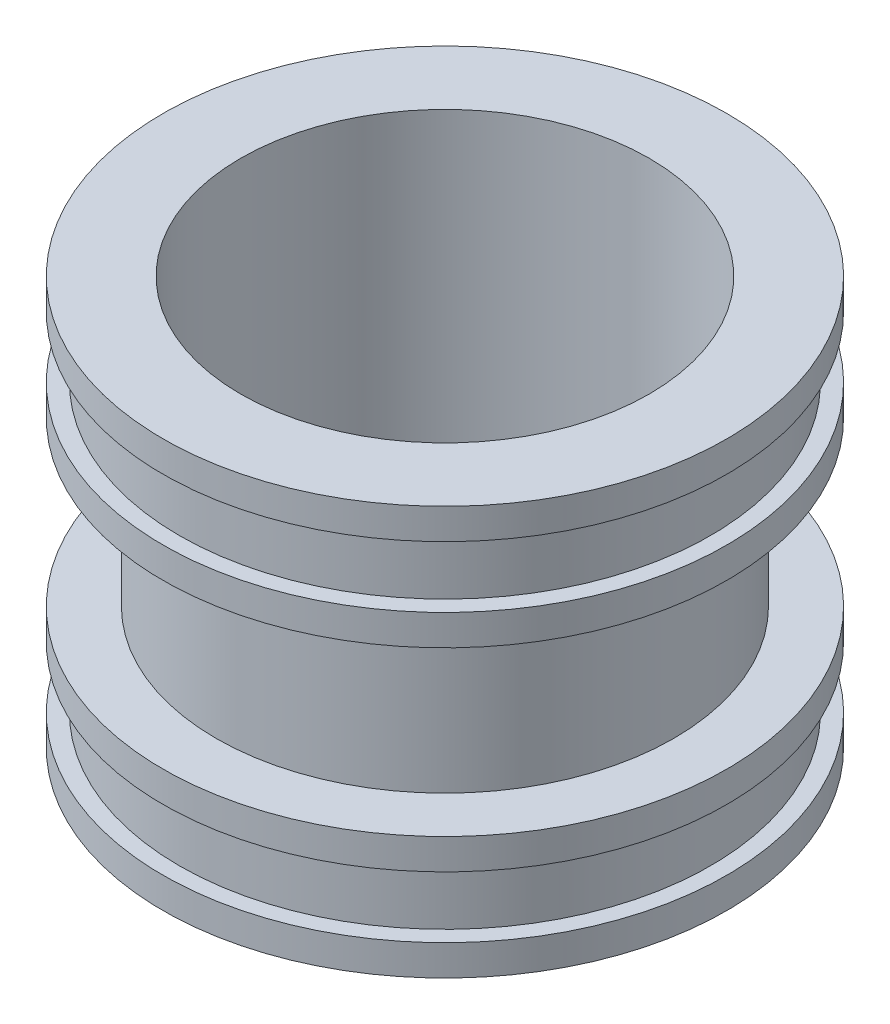
ISO-10303-21;
HEADER;
FILE_DESCRIPTION(('STEP AP214'),'2;1');
FILE_NAME('part.step','',(''),(''),'','','');
FILE_SCHEMA(('AUTOMOTIVE_DESIGN { 1 0 10303 214 1 1 1 1 }'));
ENDSEC;
DATA;
#1=APPLICATION_CONTEXT('core data for automotive mechanical design processes');
#2=APPLICATION_PROTOCOL_DEFINITION('international standard','automotive_design',2000,#1);
#3=PRODUCT_CONTEXT('',#1,'mechanical');
#4=PRODUCT('Part','Part','',(#3));
#5=PRODUCT_RELATED_PRODUCT_CATEGORY('part','',(#4));
#6=PRODUCT_DEFINITION_FORMATION('','',#4);
#7=PRODUCT_DEFINITION_CONTEXT('part definition',#1,'design');
#8=PRODUCT_DEFINITION('design','',#6,#7);
#9=PRODUCT_DEFINITION_SHAPE('','',#8);
#10=(LENGTH_UNIT() NAMED_UNIT(*) SI_UNIT(.MILLI.,.METRE.));
#11=(NAMED_UNIT(*) PLANE_ANGLE_UNIT() SI_UNIT($,.RADIAN.));
#12=(NAMED_UNIT(*) SI_UNIT($,.STERADIAN.) SOLID_ANGLE_UNIT());
#13=UNCERTAINTY_MEASURE_WITH_UNIT(LENGTH_MEASURE(1.E-05),#10,'distance_accuracy_value','');
#14=(GEOMETRIC_REPRESENTATION_CONTEXT(3) GLOBAL_UNCERTAINTY_ASSIGNED_CONTEXT((#13)) GLOBAL_UNIT_ASSIGNED_CONTEXT((#10,
#11,#12)) REPRESENTATION_CONTEXT('',''));
#15=CARTESIAN_POINT('',(0.,0.,0.));
#16=DIRECTION('',(0.,0.,1.));
#17=DIRECTION('',(1.,0.,0.));
#18=AXIS2_PLACEMENT_3D('',#15,#16,#17);
#19=CARTESIAN_POINT('',(0.,0.,0.));
#20=DIRECTION('',(0.,-1.,0.));
#21=DIRECTION('',(0.,0.,-1.));
#22=AXIS2_PLACEMENT_3D('',#19,#20,#21);
#23=CYLINDRICAL_SURFACE('',#22,50.);
#24=CARTESIAN_POINT('',(0.,0.,0.));
#25=DIRECTION('',(0.,-1.,0.));
#26=DIRECTION('',(0.,0.,-1.));
#27=AXIS2_PLACEMENT_3D('',#24,#25,#26);
#28=CIRCLE('',#27,50.);
#29=CARTESIAN_POINT('',(0.,0.,-50.));
#30=VERTEX_POINT('',#29);
#31=EDGE_CURVE('E85',#30,#30,#28,.T.);
#32=ORIENTED_EDGE('',*,*,#31,.T.);
#33=EDGE_LOOP('',(#32));
#34=FACE_BOUND('',#33,.T.);
#35=CARTESIAN_POINT('',(0.,100.,0.));
#36=DIRECTION('',(0.,-1.,0.));
#37=DIRECTION('',(0.,0.,-1.));
#38=AXIS2_PLACEMENT_3D('',#35,#36,#37);
#39=CIRCLE('',#38,50.);
#40=CARTESIAN_POINT('',(0.,100.,-50.));
#41=VERTEX_POINT('',#40);
#42=EDGE_CURVE('E10',#41,#41,#39,.T.);
#43=ORIENTED_EDGE('',*,*,#42,.F.);
#44=EDGE_LOOP('',(#43));
#45=FACE_BOUND('',#44,.T.);
#46=ADVANCED_FACE('F33',(#34,#45),#23,.F.);
#47=CARTESIAN_POINT('',(50.,100.,0.));
#48=DIRECTION('',(0.,1.,0.));
#49=DIRECTION('',(0.,0.,1.));
#50=AXIS2_PLACEMENT_3D('',#47,#48,#49);
#51=PLANE('',#50);
#52=ORIENTED_EDGE('',*,*,#42,.T.);
#53=EDGE_LOOP('',(#52));
#54=FACE_BOUND('',#53,.T.);
#55=CARTESIAN_POINT('',(0.,100.,0.));
#56=DIRECTION('',(0.,-1.,0.));
#57=DIRECTION('',(0.,0.,-1.));
#58=AXIS2_PLACEMENT_3D('',#55,#56,#57);
#59=CIRCLE('',#58,69.);
#60=CARTESIAN_POINT('',(0.,100.,-69.));
#61=VERTEX_POINT('',#60);
#62=EDGE_CURVE('E39',#61,#61,#59,.T.);
#63=ORIENTED_EDGE('',*,*,#62,.F.);
#64=EDGE_LOOP('',(#63));
#65=FACE_BOUND('',#64,.T.);
#66=ADVANCED_FACE('F103',(#54,#65),#51,.T.);
#67=CARTESIAN_POINT('',(0.,0.,0.));
#68=DIRECTION('',(0.,-1.,0.));
#69=DIRECTION('',(0.,0.,-1.));
#70=AXIS2_PLACEMENT_3D('',#67,#68,#69);
#71=CYLINDRICAL_SURFACE('',#70,69.);
#72=ORIENTED_EDGE('',*,*,#62,.T.);
#73=EDGE_LOOP('',(#72));
#74=FACE_BOUND('',#73,.T.);
#75=CARTESIAN_POINT('',(0.,92.5,0.));
#76=DIRECTION('',(0.,-1.,0.));
#77=DIRECTION('',(0.,0.,-1.));
#78=AXIS2_PLACEMENT_3D('',#75,#76,#77);
#79=CIRCLE('',#78,69.);
#80=CARTESIAN_POINT('',(0.,92.5,-69.));
#81=VERTEX_POINT('',#80);
#82=EDGE_CURVE('E43',#81,#81,#79,.T.);
#83=ORIENTED_EDGE('',*,*,#82,.F.);
#84=EDGE_LOOP('',(#83));
#85=FACE_BOUND('',#84,.T.);
#86=ADVANCED_FACE('F107',(#74,#85),#71,.T.);
#87=CARTESIAN_POINT('',(69.,92.5,0.));
#88=DIRECTION('',(0.,-1.,0.));
#89=DIRECTION('',(0.,0.,-1.));
#90=AXIS2_PLACEMENT_3D('',#87,#88,#89);
#91=PLANE('',#90);
#92=ORIENTED_EDGE('',*,*,#82,.T.);
#93=EDGE_LOOP('',(#92));
#94=FACE_BOUND('',#93,.T.);
#95=CARTESIAN_POINT('',(0.,92.5,0.));
#96=DIRECTION('',(0.,-1.,0.));
#97=DIRECTION('',(0.,0.,-1.));
#98=AXIS2_PLACEMENT_3D('',#95,#96,#97);
#99=CIRCLE('',#98,65.);
#100=CARTESIAN_POINT('',(0.,92.5,-65.));
#101=VERTEX_POINT('',#100);
#102=EDGE_CURVE('E47',#101,#101,#99,.T.);
#103=ORIENTED_EDGE('',*,*,#102,.F.);
#104=EDGE_LOOP('',(#103));
#105=FACE_BOUND('',#104,.T.);
#106=ADVANCED_FACE('F111',(#94,#105),#91,.T.);
#107=CARTESIAN_POINT('',(0.,0.,0.));
#108=DIRECTION('',(0.,-1.,0.));
#109=DIRECTION('',(0.,0.,-1.));
#110=AXIS2_PLACEMENT_3D('',#107,#108,#109);
#111=CYLINDRICAL_SURFACE('',#110,65.);
#112=ORIENTED_EDGE('',*,*,#102,.T.);
#113=EDGE_LOOP('',(#112));
#114=FACE_BOUND('',#113,.T.);
#115=CARTESIAN_POINT('',(0.,77.5,0.));
#116=DIRECTION('',(0.,-1.,0.));
#117=DIRECTION('',(0.,0.,-1.));
#118=AXIS2_PLACEMENT_3D('',#115,#116,#117);
#119=CIRCLE('',#118,65.);
#120=CARTESIAN_POINT('',(0.,77.5,-65.));
#121=VERTEX_POINT('',#120);
#122=EDGE_CURVE('E52',#121,#121,#119,.T.);
#123=ORIENTED_EDGE('',*,*,#122,.F.);
#124=EDGE_LOOP('',(#123));
#125=FACE_BOUND('',#124,.T.);
#126=ADVANCED_FACE('F117',(#114,#125),#111,.T.);
#127=CARTESIAN_POINT('',(65.,77.5,0.));
#128=DIRECTION('',(0.,1.,0.));
#129=DIRECTION('',(0.,0.,1.));
#130=AXIS2_PLACEMENT_3D('',#127,#128,#129);
#131=PLANE('',#130);
#132=ORIENTED_EDGE('',*,*,#122,.T.);
#133=EDGE_LOOP('',(#132));
#134=FACE_BOUND('',#133,.T.);
#135=CARTESIAN_POINT('',(0.,77.5,0.));
#136=DIRECTION('',(0.,-1.,0.));
#137=DIRECTION('',(0.,0.,-1.));
#138=AXIS2_PLACEMENT_3D('',#135,#136,#137);
#139=CIRCLE('',#138,69.);
#140=CARTESIAN_POINT('',(0.,77.5,-69.));
#141=VERTEX_POINT('',#140);
#142=EDGE_CURVE('E55',#141,#141,#139,.T.);
#143=ORIENTED_EDGE('',*,*,#142,.F.);
#144=EDGE_LOOP('',(#143));
#145=FACE_BOUND('',#144,.T.);
#146=ADVANCED_FACE('F121',(#134,#145),#131,.T.);
#147=CARTESIAN_POINT('',(0.,0.,0.));
#148=DIRECTION('',(0.,-1.,0.));
#149=DIRECTION('',(0.,0.,-1.));
#150=AXIS2_PLACEMENT_3D('',#147,#148,#149);
#151=CYLINDRICAL_SURFACE('',#150,69.);
#152=ORIENTED_EDGE('',*,*,#142,.T.);
#153=EDGE_LOOP('',(#152));
#154=FACE_BOUND('',#153,.T.);
#155=CARTESIAN_POINT('',(0.,70.,0.));
#156=DIRECTION('',(0.,-1.,0.));
#157=DIRECTION('',(0.,0.,-1.));
#158=AXIS2_PLACEMENT_3D('',#155,#156,#157);
#159=CIRCLE('',#158,69.);
#160=CARTESIAN_POINT('',(0.,70.,-69.));
#161=VERTEX_POINT('',#160);
#162=EDGE_CURVE('E58',#161,#161,#159,.T.);
#163=ORIENTED_EDGE('',*,*,#162,.F.);
#164=EDGE_LOOP('',(#163));
#165=FACE_BOUND('',#164,.T.);
#166=ADVANCED_FACE('F125',(#154,#165),#151,.T.);
#167=CARTESIAN_POINT('',(69.,70.,0.));
#168=DIRECTION('',(0.,-1.,0.));
#169=DIRECTION('',(0.,0.,-1.));
#170=AXIS2_PLACEMENT_3D('',#167,#168,#169);
#171=PLANE('',#170);
#172=ORIENTED_EDGE('',*,*,#162,.T.);
#173=EDGE_LOOP('',(#172));
#174=FACE_BOUND('',#173,.T.);
#175=CARTESIAN_POINT('',(0.,70.,0.));
#176=DIRECTION('',(0.,-1.,0.));
#177=DIRECTION('',(0.,0.,-1.));
#178=AXIS2_PLACEMENT_3D('',#175,#176,#177);
#179=CIRCLE('',#178,56.);
#180=CARTESIAN_POINT('',(0.,70.,-56.));
#181=VERTEX_POINT('',#180);
#182=EDGE_CURVE('E61',#181,#181,#179,.T.);
#183=ORIENTED_EDGE('',*,*,#182,.F.);
#184=EDGE_LOOP('',(#183));
#185=FACE_BOUND('',#184,.T.);
#186=ADVANCED_FACE('F129',(#174,#185),#171,.T.);
#187=CARTESIAN_POINT('',(0.,0.,0.));
#188=DIRECTION('',(0.,-1.,0.));
#189=DIRECTION('',(0.,0.,-1.));
#190=AXIS2_PLACEMENT_3D('',#187,#188,#189);
#191=CYLINDRICAL_SURFACE('',#190,56.);
#192=ORIENTED_EDGE('',*,*,#182,.T.);
#193=EDGE_LOOP('',(#192));
#194=FACE_BOUND('',#193,.T.);
#195=CARTESIAN_POINT('',(0.,30.,0.));
#196=DIRECTION('',(0.,-1.,0.));
#197=DIRECTION('',(0.,0.,-1.));
#198=AXIS2_PLACEMENT_3D('',#195,#196,#197);
#199=CIRCLE('',#198,56.);
#200=CARTESIAN_POINT('',(0.,30.,-56.));
#201=VERTEX_POINT('',#200);
#202=EDGE_CURVE('E64',#201,#201,#199,.T.);
#203=ORIENTED_EDGE('',*,*,#202,.F.);
#204=EDGE_LOOP('',(#203));
#205=FACE_BOUND('',#204,.T.);
#206=ADVANCED_FACE('F133',(#194,#205),#191,.T.);
#207=CARTESIAN_POINT('',(56.,30.,0.));
#208=DIRECTION('',(0.,1.,0.));
#209=DIRECTION('',(0.,0.,1.));
#210=AXIS2_PLACEMENT_3D('',#207,#208,#209);
#211=PLANE('',#210);
#212=ORIENTED_EDGE('',*,*,#202,.T.);
#213=EDGE_LOOP('',(#212));
#214=FACE_BOUND('',#213,.T.);
#215=CARTESIAN_POINT('',(0.,30.,0.));
#216=DIRECTION('',(0.,-1.,0.));
#217=DIRECTION('',(0.,0.,-1.));
#218=AXIS2_PLACEMENT_3D('',#215,#216,#217);
#219=CIRCLE('',#218,69.);
#220=CARTESIAN_POINT('',(0.,30.,-69.));
#221=VERTEX_POINT('',#220);
#222=EDGE_CURVE('E67',#221,#221,#219,.T.);
#223=ORIENTED_EDGE('',*,*,#222,.F.);
#224=EDGE_LOOP('',(#223));
#225=FACE_BOUND('',#224,.T.);
#226=ADVANCED_FACE('F137',(#214,#225),#211,.T.);
#227=CARTESIAN_POINT('',(0.,0.,0.));
#228=DIRECTION('',(0.,-1.,0.));
#229=DIRECTION('',(0.,0.,-1.));
#230=AXIS2_PLACEMENT_3D('',#227,#228,#229);
#231=CYLINDRICAL_SURFACE('',#230,69.);
#232=ORIENTED_EDGE('',*,*,#222,.T.);
#233=EDGE_LOOP('',(#232));
#234=FACE_BOUND('',#233,.T.);
#235=CARTESIAN_POINT('',(0.,22.5,0.));
#236=DIRECTION('',(0.,-1.,0.));
#237=DIRECTION('',(0.,0.,-1.));
#238=AXIS2_PLACEMENT_3D('',#235,#236,#237);
#239=CIRCLE('',#238,69.);
#240=CARTESIAN_POINT('',(0.,22.5,-69.));
#241=VERTEX_POINT('',#240);
#242=EDGE_CURVE('E70',#241,#241,#239,.T.);
#243=ORIENTED_EDGE('',*,*,#242,.F.);
#244=EDGE_LOOP('',(#243));
#245=FACE_BOUND('',#244,.T.);
#246=ADVANCED_FACE('F141',(#234,#245),#231,.T.);
#247=CARTESIAN_POINT('',(65.,22.5,0.));
#248=DIRECTION('',(0.,-1.,0.));
#249=DIRECTION('',(0.,0.,-1.));
#250=AXIS2_PLACEMENT_3D('',#247,#248,#249);
#251=PLANE('',#250);
#252=ORIENTED_EDGE('',*,*,#242,.T.);
#253=EDGE_LOOP('',(#252));
#254=FACE_BOUND('',#253,.T.);
#255=CARTESIAN_POINT('',(0.,22.5,0.));
#256=DIRECTION('',(0.,-1.,0.));
#257=DIRECTION('',(0.,0.,-1.));
#258=AXIS2_PLACEMENT_3D('',#255,#256,#257);
#259=CIRCLE('',#258,65.);
#260=CARTESIAN_POINT('',(0.,22.5,-65.));
#261=VERTEX_POINT('',#260);
#262=EDGE_CURVE('E73',#261,#261,#259,.T.);
#263=ORIENTED_EDGE('',*,*,#262,.F.);
#264=EDGE_LOOP('',(#263));
#265=FACE_BOUND('',#264,.T.);
#266=ADVANCED_FACE('F145',(#254,#265),#251,.T.);
#267=CARTESIAN_POINT('',(0.,0.,0.));
#268=DIRECTION('',(0.,-1.,0.));
#269=DIRECTION('',(0.,0.,-1.));
#270=AXIS2_PLACEMENT_3D('',#267,#268,#269);
#271=CYLINDRICAL_SURFACE('',#270,65.);
#272=ORIENTED_EDGE('',*,*,#262,.T.);
#273=EDGE_LOOP('',(#272));
#274=FACE_BOUND('',#273,.T.);
#275=CARTESIAN_POINT('',(0.,7.50000000000001,0.));
#276=DIRECTION('',(0.,-1.,0.));
#277=DIRECTION('',(0.,0.,-1.));
#278=AXIS2_PLACEMENT_3D('',#275,#276,#277);
#279=CIRCLE('',#278,65.);
#280=CARTESIAN_POINT('',(0.,7.50000000000001,-65.));
#281=VERTEX_POINT('',#280);
#282=EDGE_CURVE('E76',#281,#281,#279,.T.);
#283=ORIENTED_EDGE('',*,*,#282,.F.);
#284=EDGE_LOOP('',(#283));
#285=FACE_BOUND('',#284,.T.);
#286=ADVANCED_FACE('F149',(#274,#285),#271,.T.);
#287=CARTESIAN_POINT('',(69.,7.50000000000001,0.));
#288=DIRECTION('',(0.,1.,0.));
#289=DIRECTION('',(0.,0.,1.));
#290=AXIS2_PLACEMENT_3D('',#287,#288,#289);
#291=PLANE('',#290);
#292=ORIENTED_EDGE('',*,*,#282,.T.);
#293=EDGE_LOOP('',(#292));
#294=FACE_BOUND('',#293,.T.);
#295=CARTESIAN_POINT('',(0.,7.50000000000001,0.));
#296=DIRECTION('',(0.,-1.,0.));
#297=DIRECTION('',(0.,0.,-1.));
#298=AXIS2_PLACEMENT_3D('',#295,#296,#297);
#299=CIRCLE('',#298,69.);
#300=CARTESIAN_POINT('',(0.,7.50000000000001,-69.));
#301=VERTEX_POINT('',#300);
#302=EDGE_CURVE('E79',#301,#301,#299,.T.);
#303=ORIENTED_EDGE('',*,*,#302,.F.);
#304=EDGE_LOOP('',(#303));
#305=FACE_BOUND('',#304,.T.);
#306=ADVANCED_FACE('F99',(#294,#305),#291,.T.);
#307=CARTESIAN_POINT('',(0.,0.,0.));
#308=DIRECTION('',(0.,-1.,0.));
#309=DIRECTION('',(0.,0.,-1.));
#310=AXIS2_PLACEMENT_3D('',#307,#308,#309);
#311=CYLINDRICAL_SURFACE('',#310,69.);
#312=ORIENTED_EDGE('',*,*,#302,.T.);
#313=EDGE_LOOP('',(#312));
#314=FACE_BOUND('',#313,.T.);
#315=CARTESIAN_POINT('',(0.,0.,0.));
#316=DIRECTION('',(0.,-1.,0.));
#317=DIRECTION('',(0.,0.,-1.));
#318=AXIS2_PLACEMENT_3D('',#315,#316,#317);
#319=CIRCLE('',#318,69.);
#320=CARTESIAN_POINT('',(0.,0.,-69.));
#321=VERTEX_POINT('',#320);
#322=EDGE_CURVE('E82',#321,#321,#319,.T.);
#323=ORIENTED_EDGE('',*,*,#322,.F.);
#324=EDGE_LOOP('',(#323));
#325=FACE_BOUND('',#324,.T.);
#326=ADVANCED_FACE('F93',(#314,#325),#311,.T.);
#327=CARTESIAN_POINT('',(69.,0.,0.));
#328=DIRECTION('',(0.,-1.,0.));
#329=DIRECTION('',(0.,0.,-1.));
#330=AXIS2_PLACEMENT_3D('',#327,#328,#329);
#331=PLANE('',#330);
#332=ORIENTED_EDGE('',*,*,#322,.T.);
#333=EDGE_LOOP('',(#332));
#334=FACE_BOUND('',#333,.T.);
#335=ORIENTED_EDGE('',*,*,#31,.F.);
#336=EDGE_LOOP('',(#335));
#337=FACE_BOUND('',#336,.T.);
#338=ADVANCED_FACE('F91',(#334,#337),#331,.T.);
#339=CLOSED_SHELL('',(#46,#66,#86,#106,#126,#146,#166,#186,#206,#226,#246,#266,#286,#306,#326,#338));
#340=MANIFOLD_SOLID_BREP('B2',#339);
#341=ADVANCED_BREP_SHAPE_REPRESENTATION('',(#18,#340),#14);
#342=SHAPE_DEFINITION_REPRESENTATION(#9,#341);
ENDSEC;
END-ISO-10303-21;
